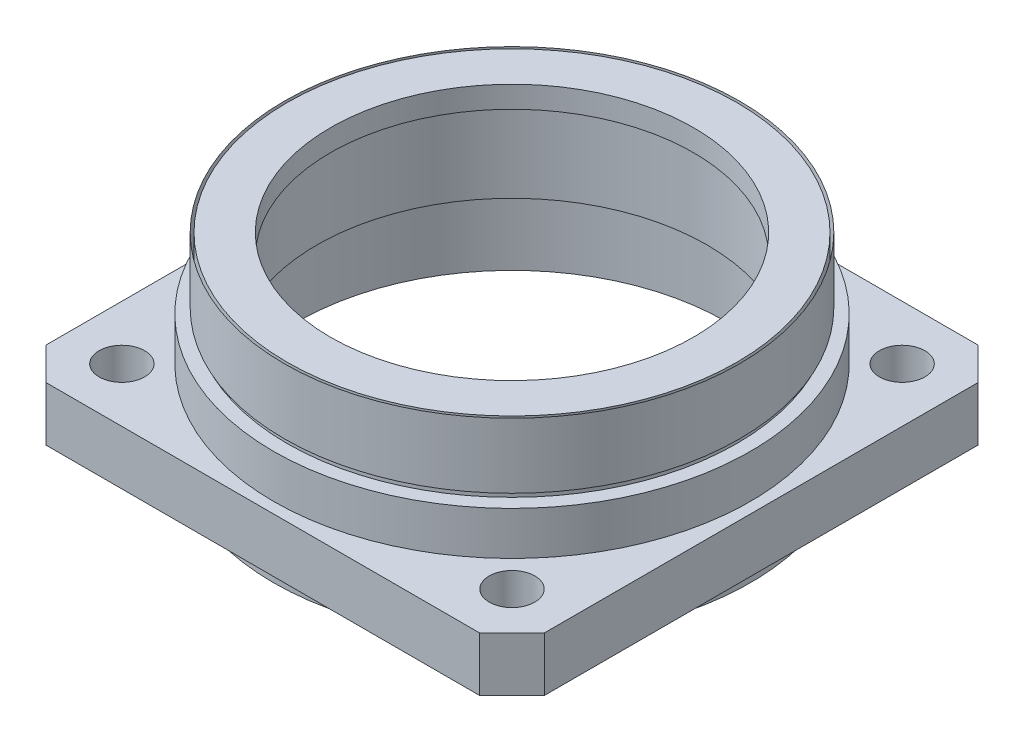
ISO-10303-21;
HEADER;
FILE_DESCRIPTION(('STEP AP214'),'2;1');
FILE_NAME('part.step','',(''),(''),'','','');
FILE_SCHEMA(('AUTOMOTIVE_DESIGN { 1 0 10303 214 1 1 1 1 }'));
ENDSEC;
DATA;
#1=APPLICATION_CONTEXT('core data for automotive mechanical design processes');
#2=APPLICATION_PROTOCOL_DEFINITION('international standard','automotive_design',2000,#1);
#3=PRODUCT_CONTEXT('',#1,'mechanical');
#4=PRODUCT('Part','Part','',(#3));
#5=PRODUCT_RELATED_PRODUCT_CATEGORY('part','',(#4));
#6=PRODUCT_DEFINITION_FORMATION('','',#4);
#7=PRODUCT_DEFINITION_CONTEXT('part definition',#1,'design');
#8=PRODUCT_DEFINITION('design','',#6,#7);
#9=PRODUCT_DEFINITION_SHAPE('','',#8);
#10=(LENGTH_UNIT() NAMED_UNIT(*) SI_UNIT(.MILLI.,.METRE.));
#11=(NAMED_UNIT(*) PLANE_ANGLE_UNIT() SI_UNIT($,.RADIAN.));
#12=(NAMED_UNIT(*) SI_UNIT($,.STERADIAN.) SOLID_ANGLE_UNIT());
#13=UNCERTAINTY_MEASURE_WITH_UNIT(LENGTH_MEASURE(1.E-05),#10,'distance_accuracy_value','');
#14=(GEOMETRIC_REPRESENTATION_CONTEXT(3) GLOBAL_UNCERTAINTY_ASSIGNED_CONTEXT((#13)) GLOBAL_UNIT_ASSIGNED_CONTEXT((#10,
#11,#12)) REPRESENTATION_CONTEXT('',''));
#15=CARTESIAN_POINT('',(0.,0.,0.));
#16=DIRECTION('',(0.,0.,1.));
#17=DIRECTION('',(1.,0.,0.));
#18=AXIS2_PLACEMENT_3D('',#15,#16,#17);
#19=CARTESIAN_POINT('',(0.,15.5,0.));
#20=DIRECTION('',(0.,1.,0.));
#21=DIRECTION('',(0.,0.,1.));
#22=AXIS2_PLACEMENT_3D('',#19,#20,#21);
#23=CYLINDRICAL_SURFACE('',#22,16.75);
#24=CARTESIAN_POINT('',(0.,15.5,0.));
#25=DIRECTION('',(0.,1.,0.));
#26=DIRECTION('',(0.,0.,1.));
#27=AXIS2_PLACEMENT_3D('',#24,#25,#26);
#28=CIRCLE('',#27,16.75);
#29=CARTESIAN_POINT('',(0.,15.5,16.75));
#30=VERTEX_POINT('',#29);
#31=EDGE_CURVE('P0_E19',#30,#30,#28,.F.);
#32=ORIENTED_EDGE('',*,*,#31,.F.);
#33=EDGE_LOOP('',(#32));
#34=FACE_BOUND('',#33,.T.);
#35=CARTESIAN_POINT('',(0.,13.5,0.));
#36=DIRECTION('',(0.,1.,0.));
#37=DIRECTION('',(0.,0.,1.));
#38=AXIS2_PLACEMENT_3D('',#35,#36,#37);
#39=CIRCLE('',#38,16.75);
#40=CARTESIAN_POINT('',(0.,13.5,16.75));
#41=VERTEX_POINT('',#40);
#42=EDGE_CURVE('P0_E160',#41,#41,#39,.F.);
#43=ORIENTED_EDGE('',*,*,#42,.T.);
#44=EDGE_LOOP('',(#43));
#45=FACE_BOUND('',#44,.T.);
#46=ADVANCED_FACE('P0_F16',(#34,#45),#23,.F.);
#47=CARTESIAN_POINT('',(0.,15.5,0.));
#48=DIRECTION('',(0.,1.,0.));
#49=DIRECTION('',(0.,0.,1.));
#50=AXIS2_PLACEMENT_3D('',#47,#48,#49);
#51=PLANE('',#50);
#52=ORIENTED_EDGE('',*,*,#31,.T.);
#53=EDGE_LOOP('',(#52));
#54=FACE_BOUND('',#53,.T.);
#55=CARTESIAN_POINT('',(0.,15.5,0.));
#56=DIRECTION('',(0.,1.,0.));
#57=DIRECTION('',(0.,0.,1.));
#58=AXIS2_PLACEMENT_3D('',#55,#56,#57);
#59=CIRCLE('',#58,20.75);
#60=CARTESIAN_POINT('',(0.,15.5,20.75));
#61=VERTEX_POINT('',#60);
#62=EDGE_CURVE('P0_E158',#61,#61,#59,.F.);
#63=ORIENTED_EDGE('',*,*,#62,.F.);
#64=EDGE_LOOP('',(#63));
#65=FACE_BOUND('',#64,.T.);
#66=ADVANCED_FACE('P0_F167',(#54,#65),#51,.T.);
#67=CARTESIAN_POINT('',(0.,13.5,0.));
#68=DIRECTION('',(0.,1.,0.));
#69=DIRECTION('',(0.,0.,1.));
#70=AXIS2_PLACEMENT_3D('',#67,#68,#69);
#71=PLANE('',#70);
#72=ORIENTED_EDGE('',*,*,#42,.F.);
#73=EDGE_LOOP('',(#72));
#74=FACE_BOUND('',#73,.T.);
#75=CARTESIAN_POINT('',(0.,13.5,0.));
#76=DIRECTION('',(0.,1.,0.));
#77=DIRECTION('',(0.,0.,1.));
#78=AXIS2_PLACEMENT_3D('',#75,#76,#77);
#79=CIRCLE('',#78,18.);
#80=CARTESIAN_POINT('',(0.,13.5,18.));
#81=VERTEX_POINT('',#80);
#82=EDGE_CURVE('P0_E155',#81,#81,#79,.F.);
#83=ORIENTED_EDGE('',*,*,#82,.T.);
#84=EDGE_LOOP('',(#83));
#85=FACE_BOUND('',#84,.T.);
#86=ADVANCED_FACE('P0_F175',(#74,#85),#71,.F.);
#87=CARTESIAN_POINT('',(0.,15.5,0.));
#88=DIRECTION('',(0.,1.,0.));
#89=DIRECTION('',(0.,0.,1.));
#90=AXIS2_PLACEMENT_3D('',#87,#88,#89);
#91=CYLINDRICAL_SURFACE('',#90,20.75);
#92=CARTESIAN_POINT('',(0.,9.,0.));
#93=DIRECTION('',(0.,1.,0.));
#94=DIRECTION('',(0.,0.,1.));
#95=AXIS2_PLACEMENT_3D('',#92,#93,#94);
#96=CIRCLE('',#95,20.75);
#97=CARTESIAN_POINT('',(0.,9.,20.75));
#98=VERTEX_POINT('',#97);
#99=EDGE_CURVE('P0_E152',#98,#98,#96,.F.);
#100=ORIENTED_EDGE('',*,*,#99,.F.);
#101=EDGE_LOOP('',(#100));
#102=FACE_BOUND('',#101,.T.);
#103=ORIENTED_EDGE('',*,*,#62,.T.);
#104=EDGE_LOOP('',(#103));
#105=FACE_BOUND('',#104,.T.);
#106=ADVANCED_FACE('P0_F257',(#102,#105),#91,.T.);
#107=CARTESIAN_POINT('',(0.,13.5,0.));
#108=DIRECTION('',(0.,1.,0.));
#109=DIRECTION('',(0.,0.,1.));
#110=AXIS2_PLACEMENT_3D('',#107,#108,#109);
#111=CYLINDRICAL_SURFACE('',#110,18.);
#112=ORIENTED_EDGE('',*,*,#82,.F.);
#113=EDGE_LOOP('',(#112));
#114=FACE_BOUND('',#113,.T.);
#115=CARTESIAN_POINT('',(0.,5.5,0.));
#116=DIRECTION('',(0.,1.,0.));
#117=DIRECTION('',(0.,0.,1.));
#118=AXIS2_PLACEMENT_3D('',#115,#116,#117);
#119=CIRCLE('',#118,18.);
#120=CARTESIAN_POINT('',(0.,5.5,18.));
#121=VERTEX_POINT('',#120);
#122=EDGE_CURVE('P0_E149',#121,#121,#119,.T.);
#123=ORIENTED_EDGE('',*,*,#122,.F.);
#124=EDGE_LOOP('',(#123));
#125=FACE_BOUND('',#124,.T.);
#126=ADVANCED_FACE('P0_F253',(#114,#125),#111,.F.);
#127=CARTESIAN_POINT('',(0.,9.,0.));
#128=DIRECTION('',(0.,1.,0.));
#129=DIRECTION('',(0.,0.,1.));
#130=AXIS2_PLACEMENT_3D('',#127,#128,#129);
#131=PLANE('',#130);
#132=ORIENTED_EDGE('',*,*,#99,.T.);
#133=EDGE_LOOP('',(#132));
#134=FACE_BOUND('',#133,.T.);
#135=CARTESIAN_POINT('',(0.,9.,0.));
#136=DIRECTION('',(0.,1.,0.));
#137=DIRECTION('',(0.,0.,1.));
#138=AXIS2_PLACEMENT_3D('',#135,#136,#137);
#139=CIRCLE('',#138,22.);
#140=CARTESIAN_POINT('',(0.,9.,22.));
#141=VERTEX_POINT('',#140);
#142=EDGE_CURVE('P0_E146',#141,#141,#139,.F.);
#143=ORIENTED_EDGE('',*,*,#142,.F.);
#144=EDGE_LOOP('',(#143));
#145=FACE_BOUND('',#144,.T.);
#146=ADVANCED_FACE('P0_F249',(#134,#145),#131,.T.);
#147=CARTESIAN_POINT('',(0.,5.5,0.));
#148=DIRECTION('',(0.,-1.,0.));
#149=DIRECTION('',(0.,0.,-1.));
#150=AXIS2_PLACEMENT_3D('',#147,#148,#149);
#151=PLANE('',#150);
#152=ORIENTED_EDGE('',*,*,#122,.T.);
#153=EDGE_LOOP('',(#152));
#154=FACE_BOUND('',#153,.T.);
#155=CARTESIAN_POINT('',(0.,5.5,0.));
#156=DIRECTION('',(0.,-1.,0.));
#157=DIRECTION('',(0.,0.,-1.));
#158=AXIS2_PLACEMENT_3D('',#155,#156,#157);
#159=CIRCLE('',#158,19.75);
#160=CARTESIAN_POINT('',(0.,5.5,-19.75));
#161=VERTEX_POINT('',#160);
#162=EDGE_CURVE('P0_E143',#161,#161,#159,.T.);
#163=ORIENTED_EDGE('',*,*,#162,.T.);
#164=EDGE_LOOP('',(#163));
#165=FACE_BOUND('',#164,.T.);
#166=ADVANCED_FACE('P0_F245',(#154,#165),#151,.T.);
#167=CARTESIAN_POINT('',(0.,-1.5,0.));
#168=DIRECTION('',(0.,1.,0.));
#169=DIRECTION('',(0.,0.,1.));
#170=AXIS2_PLACEMENT_3D('',#167,#168,#169);
#171=CYLINDRICAL_SURFACE('',#170,22.);
#172=CARTESIAN_POINT('',(0.,5.,0.));
#173=DIRECTION('',(0.,1.,0.));
#174=DIRECTION('',(0.,0.,1.));
#175=AXIS2_PLACEMENT_3D('',#172,#173,#174);
#176=CIRCLE('',#175,22.);
#177=CARTESIAN_POINT('',(0.,5.,22.));
#178=VERTEX_POINT('',#177);
#179=EDGE_CURVE('P0_E140',#178,#178,#176,.F.);
#180=ORIENTED_EDGE('',*,*,#179,.F.);
#181=EDGE_LOOP('',(#180));
#182=FACE_BOUND('',#181,.T.);
#183=ORIENTED_EDGE('',*,*,#142,.T.);
#184=EDGE_LOOP('',(#183));
#185=FACE_BOUND('',#184,.T.);
#186=ADVANCED_FACE('P0_F241',(#182,#185),#171,.T.);
#187=CARTESIAN_POINT('',(0.,-1.5,0.));
#188=DIRECTION('',(0.,-1.,0.));
#189=DIRECTION('',(0.,0.,-1.));
#190=AXIS2_PLACEMENT_3D('',#187,#188,#189);
#191=CYLINDRICAL_SURFACE('',#190,19.75);
#192=ORIENTED_EDGE('',*,*,#162,.F.);
#193=EDGE_LOOP('',(#192));
#194=FACE_BOUND('',#193,.T.);
#195=CARTESIAN_POINT('',(0.,-1.5,0.));
#196=DIRECTION('',(0.,-1.,0.));
#197=DIRECTION('',(0.,0.,-1.));
#198=AXIS2_PLACEMENT_3D('',#195,#196,#197);
#199=CIRCLE('',#198,19.75);
#200=CARTESIAN_POINT('',(0.,-1.5,-19.75));
#201=VERTEX_POINT('',#200);
#202=EDGE_CURVE('P0_E101',#201,#201,#199,.T.);
#203=ORIENTED_EDGE('',*,*,#202,.T.);
#204=EDGE_LOOP('',(#203));
#205=FACE_BOUND('',#204,.T.);
#206=ADVANCED_FACE('P0_F237',(#194,#205),#191,.F.);
#207=CARTESIAN_POINT('',(0.,5.,0.));
#208=DIRECTION('',(0.,1.,0.));
#209=DIRECTION('',(0.,0.,1.));
#210=AXIS2_PLACEMENT_3D('',#207,#208,#209);
#211=PLANE('',#210);
#212=ORIENTED_EDGE('',*,*,#179,.T.);
#213=EDGE_LOOP('',(#212));
#214=FACE_BOUND('',#213,.T.);
#215=CARTESIAN_POINT('',(18.,5.,-18.));
#216=DIRECTION('',(0.,1.,0.));
#217=DIRECTION('',(0.,0.,1.));
#218=AXIS2_PLACEMENT_3D('',#215,#216,#217);
#219=CIRCLE('',#218,2.1);
#220=CARTESIAN_POINT('',(18.,5.,-15.9));
#221=VERTEX_POINT('',#220);
#222=EDGE_CURVE('P0_E125',#221,#221,#219,.F.);
#223=ORIENTED_EDGE('',*,*,#222,.T.);
#224=EDGE_LOOP('',(#223));
#225=FACE_BOUND('',#224,.T.);
#226=CARTESIAN_POINT('',(-18.,5.,-18.));
#227=DIRECTION('',(0.,1.,0.));
#228=DIRECTION('',(0.,0.,1.));
#229=AXIS2_PLACEMENT_3D('',#226,#227,#228);
#230=CIRCLE('',#229,2.1);
#231=CARTESIAN_POINT('',(-18.,5.,-15.9));
#232=VERTEX_POINT('',#231);
#233=EDGE_CURVE('P0_E128',#232,#232,#230,.F.);
#234=ORIENTED_EDGE('',*,*,#233,.T.);
#235=EDGE_LOOP('',(#234));
#236=FACE_BOUND('',#235,.T.);
#237=CARTESIAN_POINT('',(-18.,5.,18.));
#238=DIRECTION('',(0.,1.,0.));
#239=DIRECTION('',(0.,0.,1.));
#240=AXIS2_PLACEMENT_3D('',#237,#238,#239);
#241=CIRCLE('',#240,2.1);
#242=CARTESIAN_POINT('',(-18.,5.,20.1));
#243=VERTEX_POINT('',#242);
#244=EDGE_CURVE('P0_E131',#243,#243,#241,.F.);
#245=ORIENTED_EDGE('',*,*,#244,.T.);
#246=EDGE_LOOP('',(#245));
#247=FACE_BOUND('',#246,.T.);
#248=CARTESIAN_POINT('',(18.,5.,18.));
#249=DIRECTION('',(0.,1.,0.));
#250=DIRECTION('',(0.,0.,1.));
#251=AXIS2_PLACEMENT_3D('',#248,#249,#250);
#252=CIRCLE('',#251,2.1);
#253=CARTESIAN_POINT('',(18.,5.,20.1));
#254=VERTEX_POINT('',#253);
#255=EDGE_CURVE('P0_E134',#254,#254,#252,.F.);
#256=ORIENTED_EDGE('',*,*,#255,.T.);
#257=EDGE_LOOP('',(#256));
#258=FACE_BOUND('',#257,.T.);
#259=DIRECTION('',(-1.,0.,0.));
#260=VECTOR('',#259,1.);
#261=CARTESIAN_POINT('',(23.,5.,-23.));
#262=LINE('',#261,#260);
#263=CARTESIAN_POINT('',(-20.,5.,-23.));
#264=VERTEX_POINT('',#263);
#265=CARTESIAN_POINT('',(20.,5.,-23.));
#266=VERTEX_POINT('',#265);
#267=EDGE_CURVE('P0_E97',#264,#266,#262,.F.);
#268=ORIENTED_EDGE('',*,*,#267,.F.);
#269=DIRECTION('',(-0.707106781186548,0.,0.707106781186548));
#270=VECTOR('',#269,1.);
#271=CARTESIAN_POINT('',(-21.5,5.,-21.5));
#272=LINE('',#271,#270);
#273=CARTESIAN_POINT('',(-23.,5.,-20.));
#274=VERTEX_POINT('',#273);
#275=EDGE_CURVE('P0_E92',#274,#264,#272,.F.);
#276=ORIENTED_EDGE('',*,*,#275,.F.);
#277=DIRECTION('',(0.,0.,1.));
#278=VECTOR('',#277,1.);
#279=CARTESIAN_POINT('',(-23.,5.,-23.));
#280=LINE('',#279,#278);
#281=CARTESIAN_POINT('',(-23.,5.,20.));
#282=VERTEX_POINT('',#281);
#283=EDGE_CURVE('P0_E83',#282,#274,#280,.F.);
#284=ORIENTED_EDGE('',*,*,#283,.F.);
#285=DIRECTION('',(0.707106781186548,0.,0.707106781186548));
#286=VECTOR('',#285,1.);
#287=CARTESIAN_POINT('',(-21.5,5.,21.5));
#288=LINE('',#287,#286);
#289=CARTESIAN_POINT('',(-20.,5.,23.));
#290=VERTEX_POINT('',#289);
#291=EDGE_CURVE('P0_E78',#290,#282,#288,.F.);
#292=ORIENTED_EDGE('',*,*,#291,.F.);
#293=DIRECTION('',(1.,0.,0.));
#294=VECTOR('',#293,1.);
#295=CARTESIAN_POINT('',(-23.,5.,23.));
#296=LINE('',#295,#294);
#297=CARTESIAN_POINT('',(20.,5.,23.));
#298=VERTEX_POINT('',#297);
#299=EDGE_CURVE('P0_E542',#298,#290,#296,.F.);
#300=ORIENTED_EDGE('',*,*,#299,.F.);
#301=DIRECTION('',(0.707106781186548,0.,-0.707106781186548));
#302=VECTOR('',#301,1.);
#303=CARTESIAN_POINT('',(21.5,5.,21.5));
#304=LINE('',#303,#302);
#305=CARTESIAN_POINT('',(23.,5.,20.));
#306=VERTEX_POINT('',#305);
#307=EDGE_CURVE('P0_E538',#306,#298,#304,.F.);
#308=ORIENTED_EDGE('',*,*,#307,.F.);
#309=DIRECTION('',(0.,0.,-1.));
#310=VECTOR('',#309,1.);
#311=CARTESIAN_POINT('',(23.,5.,23.));
#312=LINE('',#311,#310);
#313=CARTESIAN_POINT('',(23.,5.,-20.));
#314=VERTEX_POINT('',#313);
#315=EDGE_CURVE('P0_E534',#314,#306,#312,.F.);
#316=ORIENTED_EDGE('',*,*,#315,.F.);
#317=DIRECTION('',(-0.707106781186548,0.,-0.707106781186548));
#318=VECTOR('',#317,1.);
#319=CARTESIAN_POINT('',(21.5,5.,-21.5));
#320=LINE('',#319,#318);
#321=EDGE_CURVE('P0_E531',#266,#314,#320,.F.);
#322=ORIENTED_EDGE('',*,*,#321,.F.);
#323=EDGE_LOOP('',(#268,#276,#284,#292,#300,#308,#316,#322));
#324=FACE_BOUND('',#323,.T.);
#325=ADVANCED_FACE('P0_F95',(#214,#225,#236,#247,#258,#324),#211,.T.);
#326=CARTESIAN_POINT('',(0.,-1.5,0.));
#327=DIRECTION('',(0.,1.,0.));
#328=DIRECTION('',(0.,0.,1.));
#329=AXIS2_PLACEMENT_3D('',#326,#327,#328);
#330=PLANE('',#329);
#331=ORIENTED_EDGE('',*,*,#202,.F.);
#332=EDGE_LOOP('',(#331));
#333=FACE_BOUND('',#332,.T.);
#334=CARTESIAN_POINT('',(0.,-1.5,0.));
#335=DIRECTION('',(0.,1.,0.));
#336=DIRECTION('',(0.,0.,1.));
#337=AXIS2_PLACEMENT_3D('',#334,#335,#336);
#338=CIRCLE('',#337,22.);
#339=CARTESIAN_POINT('',(0.,-1.5,22.));
#340=VERTEX_POINT('',#339);
#341=EDGE_CURVE('P0_E122',#340,#340,#338,.T.);
#342=ORIENTED_EDGE('',*,*,#341,.F.);
#343=EDGE_LOOP('',(#342));
#344=FACE_BOUND('',#343,.T.);
#345=ADVANCED_FACE('P0_F231',(#333,#344),#330,.F.);
#346=CARTESIAN_POINT('',(-21.5,2.5,-21.5));
#347=DIRECTION('',(-0.707106781186548,0.,-0.707106781186548));
#348=DIRECTION('',(-0.707106781186548,0.,0.707106781186548));
#349=AXIS2_PLACEMENT_3D('',#346,#347,#348);
#350=PLANE('',#349);
#351=DIRECTION('',(0.,1.,0.));
#352=VECTOR('',#351,1.);
#353=CARTESIAN_POINT('',(-20.,0.,-23.));
#354=LINE('',#353,#352);
#355=CARTESIAN_POINT('',(-20.,0.,-23.));
#356=VERTEX_POINT('',#355);
#357=EDGE_CURVE('P0_E137',#356,#264,#354,.T.);
#358=ORIENTED_EDGE('',*,*,#357,.F.);
#359=DIRECTION('',(-0.707106781186548,0.,0.707106781186548));
#360=VECTOR('',#359,1.);
#361=CARTESIAN_POINT('',(-20.,0.,-23.));
#362=LINE('',#361,#360);
#363=CARTESIAN_POINT('',(-23.,0.,-20.));
#364=VERTEX_POINT('',#363);
#365=EDGE_CURVE('P0_E105',#356,#364,#362,.T.);
#366=ORIENTED_EDGE('',*,*,#365,.T.);
#367=DIRECTION('',(0.,1.,0.));
#368=VECTOR('',#367,1.);
#369=CARTESIAN_POINT('',(-23.,0.,-20.));
#370=LINE('',#369,#368);
#371=EDGE_CURVE('P0_E88',#274,#364,#370,.F.);
#372=ORIENTED_EDGE('',*,*,#371,.F.);
#373=ORIENTED_EDGE('',*,*,#275,.T.);
#374=EDGE_LOOP('',(#358,#366,#372,#373));
#375=FACE_BOUND('',#374,.T.);
#376=ADVANCED_FACE('P0_F104',(#375),#350,.T.);
#377=CARTESIAN_POINT('',(-23.,0.,-23.));
#378=DIRECTION('',(-1.,0.,0.));
#379=DIRECTION('',(0.,0.,1.));
#380=AXIS2_PLACEMENT_3D('',#377,#378,#379);
#381=PLANE('',#380);
#382=ORIENTED_EDGE('',*,*,#283,.T.);
#383=ORIENTED_EDGE('',*,*,#371,.T.);
#384=DIRECTION('',(0.,0.,1.));
#385=VECTOR('',#384,1.);
#386=CARTESIAN_POINT('',(-23.,0.,0.));
#387=LINE('',#386,#385);
#388=CARTESIAN_POINT('',(-23.,0.,20.));
#389=VERTEX_POINT('',#388);
#390=EDGE_CURVE('P0_E524',#364,#389,#387,.T.);
#391=ORIENTED_EDGE('',*,*,#390,.T.);
#392=DIRECTION('',(0.,1.,0.));
#393=VECTOR('',#392,1.);
#394=CARTESIAN_POINT('',(-23.,2.5,20.));
#395=LINE('',#394,#393);
#396=EDGE_CURVE('P0_E90',#282,#389,#395,.F.);
#397=ORIENTED_EDGE('',*,*,#396,.F.);
#398=EDGE_LOOP('',(#382,#383,#391,#397));
#399=FACE_BOUND('',#398,.T.);
#400=ADVANCED_FACE('P0_F85',(#399),#381,.T.);
#401=CARTESIAN_POINT('',(-21.5,2.5,21.5));
#402=DIRECTION('',(-0.707106781186548,0.,0.707106781186548));
#403=DIRECTION('',(0.707106781186548,0.,0.707106781186548));
#404=AXIS2_PLACEMENT_3D('',#401,#402,#403);
#405=PLANE('',#404);
#406=ORIENTED_EDGE('',*,*,#396,.T.);
#407=DIRECTION('',(0.707106781186548,0.,0.707106781186548));
#408=VECTOR('',#407,1.);
#409=CARTESIAN_POINT('',(-23.,0.,20.));
#410=LINE('',#409,#408);
#411=CARTESIAN_POINT('',(-20.,0.,23.));
#412=VERTEX_POINT('',#411);
#413=EDGE_CURVE('P0_E521',#389,#412,#410,.T.);
#414=ORIENTED_EDGE('',*,*,#413,.T.);
#415=DIRECTION('',(0.,1.,0.));
#416=VECTOR('',#415,1.);
#417=CARTESIAN_POINT('',(-20.,0.,23.));
#418=LINE('',#417,#416);
#419=EDGE_CURVE('P0_E540',#290,#412,#418,.F.);
#420=ORIENTED_EDGE('',*,*,#419,.F.);
#421=ORIENTED_EDGE('',*,*,#291,.T.);
#422=EDGE_LOOP('',(#406,#414,#420,#421));
#423=FACE_BOUND('',#422,.T.);
#424=ADVANCED_FACE('P0_F223',(#423),#405,.T.);
#425=CARTESIAN_POINT('',(-23.,0.,23.));
#426=DIRECTION('',(0.,0.,1.));
#427=DIRECTION('',(1.,0.,0.));
#428=AXIS2_PLACEMENT_3D('',#425,#426,#427);
#429=PLANE('',#428);
#430=ORIENTED_EDGE('',*,*,#299,.T.);
#431=ORIENTED_EDGE('',*,*,#419,.T.);
#432=DIRECTION('',(1.,0.,0.));
#433=VECTOR('',#432,1.);
#434=CARTESIAN_POINT('',(0.,0.,23.));
#435=LINE('',#434,#433);
#436=CARTESIAN_POINT('',(20.,0.,23.));
#437=VERTEX_POINT('',#436);
#438=EDGE_CURVE('P0_E515',#412,#437,#435,.T.);
#439=ORIENTED_EDGE('',*,*,#438,.T.);
#440=DIRECTION('',(0.,1.,0.));
#441=VECTOR('',#440,1.);
#442=CARTESIAN_POINT('',(20.,2.5,23.));
#443=LINE('',#442,#441);
#444=EDGE_CURVE('P0_E536',#298,#437,#443,.F.);
#445=ORIENTED_EDGE('',*,*,#444,.F.);
#446=EDGE_LOOP('',(#430,#431,#439,#445));
#447=FACE_BOUND('',#446,.T.);
#448=ADVANCED_FACE('P0_F219',(#447),#429,.T.);
#449=CARTESIAN_POINT('',(21.5,2.5,21.5));
#450=DIRECTION('',(0.707106781186548,0.,0.707106781186548));
#451=DIRECTION('',(0.707106781186548,0.,-0.707106781186548));
#452=AXIS2_PLACEMENT_3D('',#449,#450,#451);
#453=PLANE('',#452);
#454=ORIENTED_EDGE('',*,*,#444,.T.);
#455=DIRECTION('',(0.707106781186548,0.,-0.707106781186548));
#456=VECTOR('',#455,1.);
#457=CARTESIAN_POINT('',(20.,0.,23.));
#458=LINE('',#457,#456);
#459=CARTESIAN_POINT('',(23.,0.,20.));
#460=VERTEX_POINT('',#459);
#461=EDGE_CURVE('P0_E513',#437,#460,#458,.T.);
#462=ORIENTED_EDGE('',*,*,#461,.T.);
#463=DIRECTION('',(0.,1.,0.));
#464=VECTOR('',#463,1.);
#465=CARTESIAN_POINT('',(23.,0.,20.));
#466=LINE('',#465,#464);
#467=EDGE_CURVE('P0_E512',#306,#460,#466,.F.);
#468=ORIENTED_EDGE('',*,*,#467,.F.);
#469=ORIENTED_EDGE('',*,*,#307,.T.);
#470=EDGE_LOOP('',(#454,#462,#468,#469));
#471=FACE_BOUND('',#470,.T.);
#472=ADVANCED_FACE('P0_F215',(#471),#453,.T.);
#473=CARTESIAN_POINT('',(23.,0.,23.));
#474=DIRECTION('',(1.,0.,0.));
#475=DIRECTION('',(0.,0.,-1.));
#476=AXIS2_PLACEMENT_3D('',#473,#474,#475);
#477=PLANE('',#476);
#478=ORIENTED_EDGE('',*,*,#315,.T.);
#479=ORIENTED_EDGE('',*,*,#467,.T.);
#480=DIRECTION('',(0.,0.,1.));
#481=VECTOR('',#480,1.);
#482=CARTESIAN_POINT('',(23.,0.,0.));
#483=LINE('',#482,#481);
#484=CARTESIAN_POINT('',(23.,0.,-20.));
#485=VERTEX_POINT('',#484);
#486=EDGE_CURVE('P0_E506',#460,#485,#483,.F.);
#487=ORIENTED_EDGE('',*,*,#486,.T.);
#488=DIRECTION('',(0.,1.,0.));
#489=VECTOR('',#488,1.);
#490=CARTESIAN_POINT('',(23.,2.5,-20.));
#491=LINE('',#490,#489);
#492=EDGE_CURVE('P0_E510',#314,#485,#491,.F.);
#493=ORIENTED_EDGE('',*,*,#492,.F.);
#494=EDGE_LOOP('',(#478,#479,#487,#493));
#495=FACE_BOUND('',#494,.T.);
#496=ADVANCED_FACE('P0_F211',(#495),#477,.T.);
#497=CARTESIAN_POINT('',(21.5,2.5,-21.5));
#498=DIRECTION('',(0.707106781186548,0.,-0.707106781186548));
#499=DIRECTION('',(-0.707106781186548,0.,-0.707106781186548));
#500=AXIS2_PLACEMENT_3D('',#497,#498,#499);
#501=PLANE('',#500);
#502=ORIENTED_EDGE('',*,*,#492,.T.);
#503=DIRECTION('',(-0.707106781186548,0.,-0.707106781186548));
#504=VECTOR('',#503,1.);
#505=CARTESIAN_POINT('',(23.,0.,-20.));
#506=LINE('',#505,#504);
#507=CARTESIAN_POINT('',(20.,0.,-23.));
#508=VERTEX_POINT('',#507);
#509=EDGE_CURVE('P0_E503',#485,#508,#506,.T.);
#510=ORIENTED_EDGE('',*,*,#509,.T.);
#511=DIRECTION('',(0.,1.,0.));
#512=VECTOR('',#511,1.);
#513=CARTESIAN_POINT('',(20.,0.,-23.));
#514=LINE('',#513,#512);
#515=EDGE_CURVE('P0_E34',#266,#508,#514,.F.);
#516=ORIENTED_EDGE('',*,*,#515,.F.);
#517=ORIENTED_EDGE('',*,*,#321,.T.);
#518=EDGE_LOOP('',(#502,#510,#516,#517));
#519=FACE_BOUND('',#518,.T.);
#520=ADVANCED_FACE('P0_F208',(#519),#501,.T.);
#521=CARTESIAN_POINT('',(23.,0.,-23.));
#522=DIRECTION('',(0.,0.,-1.));
#523=DIRECTION('',(-1.,0.,0.));
#524=AXIS2_PLACEMENT_3D('',#521,#522,#523);
#525=PLANE('',#524);
#526=DIRECTION('',(1.,0.,0.));
#527=VECTOR('',#526,1.);
#528=CARTESIAN_POINT('',(0.,0.,-23.));
#529=LINE('',#528,#527);
#530=EDGE_CURVE('P0_E121',#508,#356,#529,.F.);
#531=ORIENTED_EDGE('',*,*,#530,.T.);
#532=ORIENTED_EDGE('',*,*,#357,.T.);
#533=ORIENTED_EDGE('',*,*,#267,.T.);
#534=ORIENTED_EDGE('',*,*,#515,.T.);
#535=EDGE_LOOP('',(#531,#532,#533,#534));
#536=FACE_BOUND('',#535,.T.);
#537=ADVANCED_FACE('P0_F204',(#536),#525,.T.);
#538=CARTESIAN_POINT('',(18.,5.,18.));
#539=DIRECTION('',(0.,1.,0.));
#540=DIRECTION('',(0.,0.,1.));
#541=AXIS2_PLACEMENT_3D('',#538,#539,#540);
#542=CYLINDRICAL_SURFACE('',#541,2.1);
#543=ORIENTED_EDGE('',*,*,#255,.F.);
#544=EDGE_LOOP('',(#543));
#545=FACE_BOUND('',#544,.T.);
#546=CARTESIAN_POINT('',(18.,0.,18.));
#547=DIRECTION('',(0.,1.,0.));
#548=DIRECTION('',(0.,0.,1.));
#549=AXIS2_PLACEMENT_3D('',#546,#547,#548);
#550=CIRCLE('',#549,2.1);
#551=CARTESIAN_POINT('',(18.,0.,20.1));
#552=VERTEX_POINT('',#551);
#553=EDGE_CURVE('P0_E118',#552,#552,#550,.F.);
#554=ORIENTED_EDGE('',*,*,#553,.T.);
#555=EDGE_LOOP('',(#554));
#556=FACE_BOUND('',#555,.T.);
#557=ADVANCED_FACE('P0_F200',(#545,#556),#542,.F.);
#558=CARTESIAN_POINT('',(-18.,5.,18.));
#559=DIRECTION('',(0.,1.,0.));
#560=DIRECTION('',(0.,0.,1.));
#561=AXIS2_PLACEMENT_3D('',#558,#559,#560);
#562=CYLINDRICAL_SURFACE('',#561,2.1);
#563=ORIENTED_EDGE('',*,*,#244,.F.);
#564=EDGE_LOOP('',(#563));
#565=FACE_BOUND('',#564,.T.);
#566=CARTESIAN_POINT('',(-18.,0.,18.));
#567=DIRECTION('',(0.,1.,0.));
#568=DIRECTION('',(0.,0.,1.));
#569=AXIS2_PLACEMENT_3D('',#566,#567,#568);
#570=CIRCLE('',#569,2.1);
#571=CARTESIAN_POINT('',(-18.,0.,20.1));
#572=VERTEX_POINT('',#571);
#573=EDGE_CURVE('P0_E115',#572,#572,#570,.F.);
#574=ORIENTED_EDGE('',*,*,#573,.T.);
#575=EDGE_LOOP('',(#574));
#576=FACE_BOUND('',#575,.T.);
#577=ADVANCED_FACE('P0_F196',(#565,#576),#562,.F.);
#578=CARTESIAN_POINT('',(-18.,5.,-18.));
#579=DIRECTION('',(0.,1.,0.));
#580=DIRECTION('',(0.,0.,1.));
#581=AXIS2_PLACEMENT_3D('',#578,#579,#580);
#582=CYLINDRICAL_SURFACE('',#581,2.1);
#583=ORIENTED_EDGE('',*,*,#233,.F.);
#584=EDGE_LOOP('',(#583));
#585=FACE_BOUND('',#584,.T.);
#586=CARTESIAN_POINT('',(-18.,0.,-18.));
#587=DIRECTION('',(0.,1.,0.));
#588=DIRECTION('',(0.,0.,1.));
#589=AXIS2_PLACEMENT_3D('',#586,#587,#588);
#590=CIRCLE('',#589,2.1);
#591=CARTESIAN_POINT('',(-18.,0.,-15.9));
#592=VERTEX_POINT('',#591);
#593=EDGE_CURVE('P0_E112',#592,#592,#590,.F.);
#594=ORIENTED_EDGE('',*,*,#593,.T.);
#595=EDGE_LOOP('',(#594));
#596=FACE_BOUND('',#595,.T.);
#597=ADVANCED_FACE('P0_F192',(#585,#596),#582,.F.);
#598=CARTESIAN_POINT('',(18.,5.,-18.));
#599=DIRECTION('',(0.,1.,0.));
#600=DIRECTION('',(0.,0.,1.));
#601=AXIS2_PLACEMENT_3D('',#598,#599,#600);
#602=CYLINDRICAL_SURFACE('',#601,2.1);
#603=ORIENTED_EDGE('',*,*,#222,.F.);
#604=EDGE_LOOP('',(#603));
#605=FACE_BOUND('',#604,.T.);
#606=CARTESIAN_POINT('',(18.,0.,-18.));
#607=DIRECTION('',(0.,1.,0.));
#608=DIRECTION('',(0.,0.,1.));
#609=AXIS2_PLACEMENT_3D('',#606,#607,#608);
#610=CIRCLE('',#609,2.1);
#611=CARTESIAN_POINT('',(18.,0.,-15.9));
#612=VERTEX_POINT('',#611);
#613=EDGE_CURVE('P0_E25',#612,#612,#610,.F.);
#614=ORIENTED_EDGE('',*,*,#613,.T.);
#615=EDGE_LOOP('',(#614));
#616=FACE_BOUND('',#615,.T.);
#617=ADVANCED_FACE('P0_F184',(#605,#616),#602,.F.);
#618=CARTESIAN_POINT('',(0.,-1.5,0.));
#619=DIRECTION('',(0.,1.,0.));
#620=DIRECTION('',(0.,0.,1.));
#621=AXIS2_PLACEMENT_3D('',#618,#619,#620);
#622=CYLINDRICAL_SURFACE('',#621,22.);
#623=ORIENTED_EDGE('',*,*,#341,.T.);
#624=EDGE_LOOP('',(#623));
#625=FACE_BOUND('',#624,.T.);
#626=CARTESIAN_POINT('',(0.,0.,0.));
#627=DIRECTION('',(0.,1.,0.));
#628=DIRECTION('',(0.,0.,1.));
#629=AXIS2_PLACEMENT_3D('',#626,#627,#628);
#630=CIRCLE('',#629,22.);
#631=CARTESIAN_POINT('',(0.,0.,22.));
#632=VERTEX_POINT('',#631);
#633=EDGE_CURVE('P0_E11',#632,#632,#630,.F.);
#634=ORIENTED_EDGE('',*,*,#633,.T.);
#635=EDGE_LOOP('',(#634));
#636=FACE_BOUND('',#635,.T.);
#637=ADVANCED_FACE('P0_F178',(#625,#636),#622,.T.);
#638=CARTESIAN_POINT('',(0.,0.,0.));
#639=DIRECTION('',(0.,1.,0.));
#640=DIRECTION('',(0.,0.,1.));
#641=AXIS2_PLACEMENT_3D('',#638,#639,#640);
#642=PLANE('',#641);
#643=ORIENTED_EDGE('',*,*,#633,.F.);
#644=EDGE_LOOP('',(#643));
#645=FACE_BOUND('',#644,.T.);
#646=ORIENTED_EDGE('',*,*,#613,.F.);
#647=EDGE_LOOP('',(#646));
#648=FACE_BOUND('',#647,.T.);
#649=ORIENTED_EDGE('',*,*,#593,.F.);
#650=EDGE_LOOP('',(#649));
#651=FACE_BOUND('',#650,.T.);
#652=ORIENTED_EDGE('',*,*,#573,.F.);
#653=EDGE_LOOP('',(#652));
#654=FACE_BOUND('',#653,.T.);
#655=ORIENTED_EDGE('',*,*,#553,.F.);
#656=EDGE_LOOP('',(#655));
#657=FACE_BOUND('',#656,.T.);
#658=ORIENTED_EDGE('',*,*,#509,.F.);
#659=ORIENTED_EDGE('',*,*,#486,.F.);
#660=ORIENTED_EDGE('',*,*,#461,.F.);
#661=ORIENTED_EDGE('',*,*,#438,.F.);
#662=ORIENTED_EDGE('',*,*,#413,.F.);
#663=ORIENTED_EDGE('',*,*,#390,.F.);
#664=ORIENTED_EDGE('',*,*,#365,.F.);
#665=ORIENTED_EDGE('',*,*,#530,.F.);
#666=EDGE_LOOP('',(#658,#659,#660,#661,#662,#663,#664,#665));
#667=FACE_BOUND('',#666,.T.);
#668=ADVANCED_FACE('P0_F176',(#645,#648,#651,#654,#657,#667),#642,.F.);
#669=CLOSED_SHELL('',(#46,#66,#86,#106,#126,#146,#166,#186,#206,#325,#345,#376,#400,#424,#448,
#472,#496,#520,#537,#557,#577,#597,#617,#637,#668));
#670=MANIFOLD_SOLID_BREP('P0_B1',#669);
#671=CARTESIAN_POINT('',(0.,15.5,0.));
#672=DIRECTION('',(0.,1.,0.));
#673=DIRECTION('',(0.,0.,1.));
#674=AXIS2_PLACEMENT_3D('',#671,#672,#673);
#675=CYLINDRICAL_SURFACE('',#674,21.);
#676=CARTESIAN_POINT('',(0.,9.5,0.));
#677=DIRECTION('',(0.,1.,0.));
#678=DIRECTION('',(0.,0.,1.));
#679=AXIS2_PLACEMENT_3D('',#676,#677,#678);
#680=CIRCLE('',#679,21.);
#681=CARTESIAN_POINT('',(0.,9.5,21.));
#682=VERTEX_POINT('',#681);
#683=EDGE_CURVE('P1_E20',#682,#682,#680,.T.);
#684=ORIENTED_EDGE('',*,*,#683,.T.);
#685=EDGE_LOOP('',(#684));
#686=FACE_BOUND('',#685,.T.);
#687=CARTESIAN_POINT('',(0.,15.5,0.));
#688=DIRECTION('',(0.,1.,0.));
#689=DIRECTION('',(0.,0.,1.));
#690=AXIS2_PLACEMENT_3D('',#687,#688,#689);
#691=CIRCLE('',#690,21.);
#692=CARTESIAN_POINT('',(0.,15.5,21.));
#693=VERTEX_POINT('',#692);
#694=EDGE_CURVE('P1_E11',#693,#693,#691,.F.);
#695=ORIENTED_EDGE('',*,*,#694,.T.);
#696=EDGE_LOOP('',(#695));
#697=FACE_BOUND('',#696,.T.);
#698=ADVANCED_FACE('P1_F16',(#686,#697),#675,.T.);
#699=CARTESIAN_POINT('',(0.,9.5,0.));
#700=DIRECTION('',(0.,1.,0.));
#701=DIRECTION('',(0.,0.,1.));
#702=AXIS2_PLACEMENT_3D('',#699,#700,#701);
#703=PLANE('',#702);
#704=CARTESIAN_POINT('',(20.75,9.5,0.));
#705=CARTESIAN_POINT('',(20.749902672932,9.5,1.90401726560602));
#706=CARTESIAN_POINT('',(20.4035863946439,9.5,3.775733337552));
#707=CARTESIAN_POINT('',(20.0363775923107,9.5,5.76036605676638));
#708=CARTESIAN_POINT('',(19.2931072470454,9.5,7.63796522340886));
#709=CARTESIAN_POINT('',(18.5190185855643,9.5,9.59341553158113));
#710=CARTESIAN_POINT('',(17.367656857787,9.5,11.3546023827417));
#711=CARTESIAN_POINT('',(16.1921885619372,9.5,13.1526639794246));
#712=CARTESIAN_POINT('',(14.6724657096209,9.5,14.6724657096209));
#713=CARTESIAN_POINT('',(13.1535002770118,9.5,16.1915099807976));
#714=CARTESIAN_POINT('',(11.3546023827417,9.5,17.367656857787));
#715=CARTESIAN_POINT('',(9.59435258912728,9.5,18.518535017173));
#716=CARTESIAN_POINT('',(7.63796522340886,9.5,19.2931072470454));
#717=CARTESIAN_POINT('',(5.76137495496026,9.5,20.0360862369222));
#718=CARTESIAN_POINT('',(3.775733337552,9.5,20.4035863946439));
#719=CARTESIAN_POINT('',(1.90428752965158,9.5,20.7499513295553));
#720=CARTESIAN_POINT('',(0.,9.5,20.75));
#721=CARTESIAN_POINT('',(-1.90322834738597,9.5,20.7500486433737));
#722=CARTESIAN_POINT('',(-3.775733337552,9.5,20.4035863946439));
#723=CARTESIAN_POINT('',(-5.76036605676638,9.5,20.0363775923107));
#724=CARTESIAN_POINT('',(-7.63796522340886,9.5,19.2931072470454));
#725=CARTESIAN_POINT('',(-9.59341553161122,9.5,18.5190185855524));
#726=CARTESIAN_POINT('',(-11.3546023827417,9.5,17.367656857787));
#727=CARTESIAN_POINT('',(-13.1526639794375,9.5,16.1921885619209));
#728=CARTESIAN_POINT('',(-14.6724657096209,9.5,14.6724657096209));
#729=CARTESIAN_POINT('',(-16.1915099808288,9.5,13.1535002769841));
#730=CARTESIAN_POINT('',(-17.367656857787,9.5,11.3546023827417));
#731=CARTESIAN_POINT('',(-18.5185350172045,9.5,9.59435258905948));
#732=CARTESIAN_POINT('',(-19.2931072470454,9.5,7.63796522340886));
#733=CARTESIAN_POINT('',(-20.0360862368984,9.5,5.76137495500918));
#734=CARTESIAN_POINT('',(-20.4035863946439,9.5,3.77573333755201));
#735=CARTESIAN_POINT('',(-20.749902645671,9.5,1.90455057382294));
#736=CARTESIAN_POINT('',(-20.75,9.5,0.));
#737=B_SPLINE_CURVE_WITH_KNOTS('',2,(#704,#705,#706,#707,#708,#709,#710,#711,#712,#713,#714,
#715,#716,#717,#718,#719,#720,#721,#722,#723,#724,#725,#726,#727,#728,#729,#730,#731,#732,#733,
#734,#735,#736),.UNSPECIFIED.,.F.,.F.,(3,2,2,2,2,2,2,2,2,2,2,2,2,2,2,2,3),(0.,0.0625,0.125,
0.1875,0.25,0.3125,0.375,0.4375,0.5,0.5625,0.625,0.6875,0.75,0.8125,0.875,0.9375,1.),.UNSPECIFIED.);
#738=CARTESIAN_POINT('',(20.75,9.5,0.));
#739=VERTEX_POINT('',#738);
#740=CARTESIAN_POINT('',(-20.75,9.5,0.));
#741=VERTEX_POINT('',#740);
#742=EDGE_CURVE('P1_E28',#739,#741,#737,.T.);
#743=ORIENTED_EDGE('',*,*,#742,.F.);
#744=CARTESIAN_POINT('',(-20.75,9.5,0.));
#745=CARTESIAN_POINT('',(-20.749902672932,9.5,-1.90401726560602));
#746=CARTESIAN_POINT('',(-20.4035863946439,9.5,-3.775733337552));
#747=CARTESIAN_POINT('',(-20.0363775923107,9.5,-5.76036605676638));
#748=CARTESIAN_POINT('',(-19.2931072470454,9.5,-7.63796522340886));
#749=CARTESIAN_POINT('',(-18.5190185855643,9.5,-9.59341553158113));
#750=CARTESIAN_POINT('',(-17.367656857787,9.5,-11.3546023827417));
#751=CARTESIAN_POINT('',(-16.1921885619372,9.5,-13.1526639794246));
#752=CARTESIAN_POINT('',(-14.6724657096209,9.5,-14.6724657096209));
#753=CARTESIAN_POINT('',(-13.1535002770118,9.5,-16.1915099807976));
#754=CARTESIAN_POINT('',(-11.3546023827417,9.5,-17.367656857787));
#755=CARTESIAN_POINT('',(-9.59435258912728,9.5,-18.518535017173));
#756=CARTESIAN_POINT('',(-7.63796522340886,9.5,-19.2931072470454));
#757=CARTESIAN_POINT('',(-5.76137495496026,9.5,-20.0360862369222));
#758=CARTESIAN_POINT('',(-3.775733337552,9.5,-20.4035863946439));
#759=CARTESIAN_POINT('',(-1.90428752965158,9.5,-20.7499513295553));
#760=CARTESIAN_POINT('',(0.,9.5,-20.75));
#761=CARTESIAN_POINT('',(1.90322834738597,9.5,-20.7500486433737));
#762=CARTESIAN_POINT('',(3.775733337552,9.5,-20.4035863946439));
#763=CARTESIAN_POINT('',(5.76036605676638,9.5,-20.0363775923107));
#764=CARTESIAN_POINT('',(7.63796522340886,9.5,-19.2931072470454));
#765=CARTESIAN_POINT('',(9.59341553161122,9.5,-18.5190185855524));
#766=CARTESIAN_POINT('',(11.3546023827417,9.5,-17.367656857787));
#767=CARTESIAN_POINT('',(13.1526639794375,9.5,-16.1921885619209));
#768=CARTESIAN_POINT('',(14.6724657096209,9.5,-14.6724657096209));
#769=CARTESIAN_POINT('',(16.1915099808288,9.5,-13.1535002769841));
#770=CARTESIAN_POINT('',(17.367656857787,9.5,-11.3546023827417));
#771=CARTESIAN_POINT('',(18.5185350172045,9.5,-9.59435258905948));
#772=CARTESIAN_POINT('',(19.2931072470454,9.5,-7.63796522340886));
#773=CARTESIAN_POINT('',(20.0360862368984,9.5,-5.76137495500918));
#774=CARTESIAN_POINT('',(20.4035863946439,9.5,-3.77573333755201));
#775=CARTESIAN_POINT('',(20.749902645671,9.5,-1.90455057382294));
#776=CARTESIAN_POINT('',(20.75,9.5,0.));
#777=B_SPLINE_CURVE_WITH_KNOTS('',2,(#744,#745,#746,#747,#748,#749,#750,#751,#752,#753,#754,
#755,#756,#757,#758,#759,#760,#761,#762,#763,#764,#765,#766,#767,#768,#769,#770,#771,#772,#773,
#774,#775,#776),.UNSPECIFIED.,.F.,.F.,(3,2,2,2,2,2,2,2,2,2,2,2,2,2,2,2,3),(0.,0.0625,0.125,
0.1875,0.25,0.3125,0.375,0.4375,0.5,0.5625,0.625,0.6875,0.75,0.8125,0.875,0.9375,1.),.UNSPECIFIED.);
#778=EDGE_CURVE('P1_E33',#741,#739,#777,.T.);
#779=ORIENTED_EDGE('',*,*,#778,.F.);
#780=EDGE_LOOP('',(#743,#779));
#781=FACE_BOUND('',#780,.T.);
#782=ORIENTED_EDGE('',*,*,#683,.F.);
#783=EDGE_LOOP('',(#782));
#784=FACE_BOUND('',#783,.T.);
#785=ADVANCED_FACE('P1_F17',(#781,#784),#703,.F.);
#786=OPEN_SHELL('',(#698,#785));
#787=SHELL_BASED_SURFACE_MODEL('P1_B1',(#786));
#788=CARTESIAN_POINT('',(0.,-1.5,0.));
#789=DIRECTION('',(0.,-1.,0.));
#790=DIRECTION('',(0.,0.,-1.));
#791=AXIS2_PLACEMENT_3D('',#788,#789,#790);
#792=CYLINDRICAL_SURFACE('',#791,20.);
#793=CARTESIAN_POINT('',(0.,5.,0.));
#794=DIRECTION('',(0.,-1.,0.));
#795=DIRECTION('',(0.,0.,-1.));
#796=AXIS2_PLACEMENT_3D('',#793,#794,#795);
#797=CIRCLE('',#796,20.);
#798=CARTESIAN_POINT('',(0.,5.,-20.));
#799=VERTEX_POINT('',#798);
#800=EDGE_CURVE('P2_E20',#799,#799,#797,.T.);
#801=ORIENTED_EDGE('',*,*,#800,.T.);
#802=EDGE_LOOP('',(#801));
#803=FACE_BOUND('',#802,.T.);
#804=CARTESIAN_POINT('',(0.,-1.5,0.));
#805=DIRECTION('',(0.,-1.,0.));
#806=DIRECTION('',(0.,0.,-1.));
#807=AXIS2_PLACEMENT_3D('',#804,#805,#806);
#808=CIRCLE('',#807,20.);
#809=CARTESIAN_POINT('',(0.,-1.5,-20.));
#810=VERTEX_POINT('',#809);
#811=EDGE_CURVE('P2_E11',#810,#810,#808,.F.);
#812=ORIENTED_EDGE('',*,*,#811,.T.);
#813=EDGE_LOOP('',(#812));
#814=FACE_BOUND('',#813,.T.);
#815=ADVANCED_FACE('P2_F16',(#803,#814),#792,.T.);
#816=CARTESIAN_POINT('',(0.,5.,0.));
#817=DIRECTION('',(0.,-1.,0.));
#818=DIRECTION('',(0.,0.,-1.));
#819=AXIS2_PLACEMENT_3D('',#816,#817,#818);
#820=PLANE('',#819);
#821=CARTESIAN_POINT('',(-19.75,5.,0.));
#822=CARTESIAN_POINT('',(-19.7499026722083,5.,1.81226990110528));
#823=CARTESIAN_POINT('',(-19.4202810262273,5.,3.59377028513986));
#824=CARTESIAN_POINT('',(-19.0707760528669,5.,5.48273374326077));
#825=CARTESIAN_POINT('',(-18.363318945983,5.,7.26987051384699));
#826=CARTESIAN_POINT('',(-17.6265474133018,5.,9.13105967254443));
#827=CARTESIAN_POINT('',(-16.5306613465684,5.,10.8073926293566));
#828=CARTESIAN_POINT('',(-15.4118584754975,5.,12.5187805024978));
#829=CARTESIAN_POINT('',(-13.9653589284343,5.,13.9653589284343));
#830=CARTESIAN_POINT('',(-12.5196168000825,5.,15.4111798943567));
#831=CARTESIAN_POINT('',(-10.8073926293566,5.,16.5306613465684));
#832=CARTESIAN_POINT('',(-9.13199673017727,5.,17.6260638448566));
#833=CARTESIAN_POINT('',(-7.26987051384699,5.,18.363318945983));
#834=CARTESIAN_POINT('',(-5.48374264155281,5.,19.0704846974582));
#835=CARTESIAN_POINT('',(-3.59377028513986,5.,19.4202810262273));
#836=CARTESIAN_POINT('',(-1.81254015939888,5.,19.7499513288447));
#837=CARTESIAN_POINT('',(0.,5.,19.75));
#838=CARTESIAN_POINT('',(1.81148097685441,5.,19.7500486427136));
#839=CARTESIAN_POINT('',(3.59377028513986,5.,19.4202810262273));
#840=CARTESIAN_POINT('',(5.48273374328496,5.,19.0707760528617));
#841=CARTESIAN_POINT('',(7.26987051384699,5.,18.363318945983));
#842=CARTESIAN_POINT('',(9.1310596725812,5.,17.6265474132827));
#843=CARTESIAN_POINT('',(10.8073926293566,5.,16.5306613465684));
#844=CARTESIAN_POINT('',(12.5187805025218,5.,15.4118584754768));
#845=CARTESIAN_POINT('',(13.9653589284343,5.,13.9653589284343));
#846=CARTESIAN_POINT('',(15.4111798943803,5.,12.5196168000556));
#847=CARTESIAN_POINT('',(16.5306613465684,5.,10.8073926293566));
#848=CARTESIAN_POINT('',(17.626063844868,5.,9.13199673015087));
#849=CARTESIAN_POINT('',(18.363318945983,5.,7.26987051384699));
#850=CARTESIAN_POINT('',(19.0704846974605,5.,5.48374264154496));
#851=CARTESIAN_POINT('',(19.4202810262273,5.,3.59377028513986));
#852=CARTESIAN_POINT('',(19.749902643567,5.,1.81280320912244));
#853=CARTESIAN_POINT('',(19.75,5.,0.));
#854=B_SPLINE_CURVE_WITH_KNOTS('',2,(#821,#822,#823,#824,#825,#826,#827,#828,#829,#830,#831,
#832,#833,#834,#835,#836,#837,#838,#839,#840,#841,#842,#843,#844,#845,#846,#847,#848,#849,#850,
#851,#852,#853),.UNSPECIFIED.,.F.,.F.,(3,2,2,2,2,2,2,2,2,2,2,2,2,2,2,2,3),(0.,0.0625,0.125,
0.1875,0.25,0.3125,0.375,0.4375,0.5,0.5625,0.625,0.6875,0.75,0.8125,0.875,0.9375,1.),.UNSPECIFIED.);
#855=CARTESIAN_POINT('',(-19.75,5.,0.));
#856=VERTEX_POINT('',#855);
#857=CARTESIAN_POINT('',(19.75,5.,0.));
#858=VERTEX_POINT('',#857);
#859=EDGE_CURVE('P2_E28',#856,#858,#854,.T.);
#860=ORIENTED_EDGE('',*,*,#859,.F.);
#861=CARTESIAN_POINT('',(19.75,5.,0.));
#862=CARTESIAN_POINT('',(19.7499026722083,5.,-1.81226990110528));
#863=CARTESIAN_POINT('',(19.4202810262273,5.,-3.59377028513986));
#864=CARTESIAN_POINT('',(19.0707760528669,5.,-5.48273374326077));
#865=CARTESIAN_POINT('',(18.363318945983,5.,-7.26987051384699));
#866=CARTESIAN_POINT('',(17.6265474133018,5.,-9.13105967254443));
#867=CARTESIAN_POINT('',(16.5306613465684,5.,-10.8073926293566));
#868=CARTESIAN_POINT('',(15.4118584754975,5.,-12.5187805024978));
#869=CARTESIAN_POINT('',(13.9653589284343,5.,-13.9653589284343));
#870=CARTESIAN_POINT('',(12.5196168000825,5.,-15.4111798943567));
#871=CARTESIAN_POINT('',(10.8073926293566,5.,-16.5306613465684));
#872=CARTESIAN_POINT('',(9.13199673017727,5.,-17.6260638448566));
#873=CARTESIAN_POINT('',(7.26987051384699,5.,-18.363318945983));
#874=CARTESIAN_POINT('',(5.48374264155281,5.,-19.0704846974582));
#875=CARTESIAN_POINT('',(3.59377028513986,5.,-19.4202810262273));
#876=CARTESIAN_POINT('',(1.81254015939888,5.,-19.7499513288447));
#877=CARTESIAN_POINT('',(0.,5.,-19.75));
#878=CARTESIAN_POINT('',(-1.81148097685441,5.,-19.7500486427136));
#879=CARTESIAN_POINT('',(-3.59377028513986,5.,-19.4202810262273));
#880=CARTESIAN_POINT('',(-5.48273374328496,5.,-19.0707760528617));
#881=CARTESIAN_POINT('',(-7.26987051384699,5.,-18.363318945983));
#882=CARTESIAN_POINT('',(-9.1310596725812,5.,-17.6265474132827));
#883=CARTESIAN_POINT('',(-10.8073926293566,5.,-16.5306613465684));
#884=CARTESIAN_POINT('',(-12.5187805025218,5.,-15.4118584754768));
#885=CARTESIAN_POINT('',(-13.9653589284343,5.,-13.9653589284343));
#886=CARTESIAN_POINT('',(-15.4111798943803,5.,-12.5196168000556));
#887=CARTESIAN_POINT('',(-16.5306613465684,5.,-10.8073926293566));
#888=CARTESIAN_POINT('',(-17.626063844868,5.,-9.13199673015087));
#889=CARTESIAN_POINT('',(-18.363318945983,5.,-7.26987051384699));
#890=CARTESIAN_POINT('',(-19.0704846974605,5.,-5.48374264154496));
#891=CARTESIAN_POINT('',(-19.4202810262273,5.,-3.59377028513986));
#892=CARTESIAN_POINT('',(-19.749902643567,5.,-1.81280320912244));
#893=CARTESIAN_POINT('',(-19.75,5.,0.));
#894=B_SPLINE_CURVE_WITH_KNOTS('',2,(#861,#862,#863,#864,#865,#866,#867,#868,#869,#870,#871,
#872,#873,#874,#875,#876,#877,#878,#879,#880,#881,#882,#883,#884,#885,#886,#887,#888,#889,#890,
#891,#892,#893),.UNSPECIFIED.,.F.,.F.,(3,2,2,2,2,2,2,2,2,2,2,2,2,2,2,2,3),(0.,0.0625,0.125,
0.1875,0.25,0.3125,0.375,0.4375,0.5,0.5625,0.625,0.6875,0.75,0.8125,0.875,0.9375,1.),.UNSPECIFIED.);
#895=EDGE_CURVE('P2_E33',#858,#856,#894,.T.);
#896=ORIENTED_EDGE('',*,*,#895,.F.);
#897=EDGE_LOOP('',(#860,#896));
#898=FACE_BOUND('',#897,.T.);
#899=ORIENTED_EDGE('',*,*,#800,.F.);
#900=EDGE_LOOP('',(#899));
#901=FACE_BOUND('',#900,.T.);
#902=ADVANCED_FACE('P2_F17',(#898,#901),#820,.F.);
#903=OPEN_SHELL('',(#815,#902));
#904=SHELL_BASED_SURFACE_MODEL('P2_B1',(#903));
#905=ADVANCED_BREP_SHAPE_REPRESENTATION('',(#18,#670),#14);
#906=MANIFOLD_SURFACE_SHAPE_REPRESENTATION('',(#18,#787,#904),#14);
#907=SHAPE_REPRESENTATION('',(#18),#14);
#908=SHAPE_DEFINITION_REPRESENTATION(#9,#907);
#909=SHAPE_REPRESENTATION_RELATIONSHIP('','',#907,#905);
#910=SHAPE_REPRESENTATION_RELATIONSHIP('','',#907,#906);
ENDSEC;
END-ISO-10303-21;
